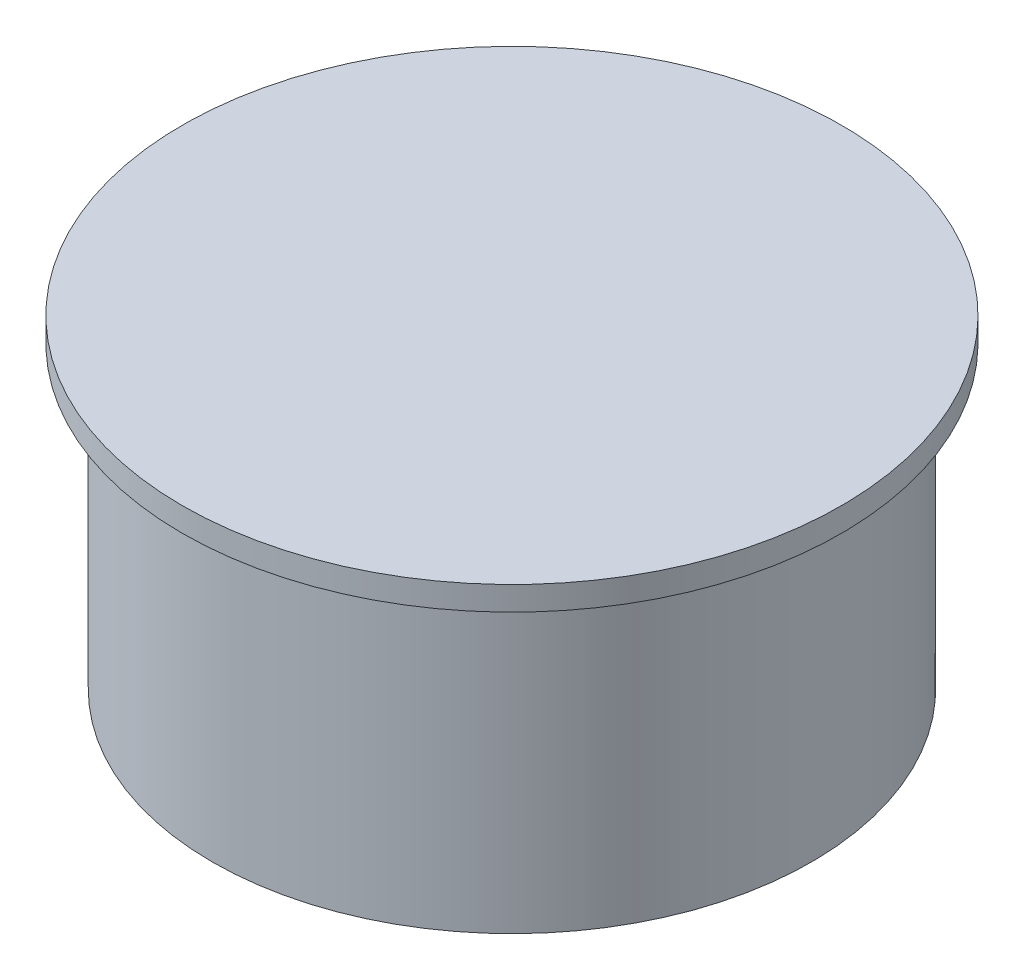
ISO-10303-21;
HEADER;
FILE_DESCRIPTION(('STEP AP214'),'2;1');
FILE_NAME('part.step','',(''),(''),'','','');
FILE_SCHEMA(('AUTOMOTIVE_DESIGN { 1 0 10303 214 1 1 1 1 }'));
ENDSEC;
DATA;
#1=APPLICATION_CONTEXT('core data for automotive mechanical design processes');
#2=APPLICATION_PROTOCOL_DEFINITION('international standard','automotive_design',2000,#1);
#3=PRODUCT_CONTEXT('',#1,'mechanical');
#4=PRODUCT('Part','Part','',(#3));
#5=PRODUCT_RELATED_PRODUCT_CATEGORY('part','',(#4));
#6=PRODUCT_DEFINITION_FORMATION('','',#4);
#7=PRODUCT_DEFINITION_CONTEXT('part definition',#1,'design');
#8=PRODUCT_DEFINITION('design','',#6,#7);
#9=PRODUCT_DEFINITION_SHAPE('','',#8);
#10=(LENGTH_UNIT() NAMED_UNIT(*) SI_UNIT(.MILLI.,.METRE.));
#11=(NAMED_UNIT(*) PLANE_ANGLE_UNIT() SI_UNIT($,.RADIAN.));
#12=(NAMED_UNIT(*) SI_UNIT($,.STERADIAN.) SOLID_ANGLE_UNIT());
#13=UNCERTAINTY_MEASURE_WITH_UNIT(LENGTH_MEASURE(1.E-05),#10,'distance_accuracy_value','');
#14=(GEOMETRIC_REPRESENTATION_CONTEXT(3) GLOBAL_UNCERTAINTY_ASSIGNED_CONTEXT((#13)) GLOBAL_UNIT_ASSIGNED_CONTEXT((#10,
#11,#12)) REPRESENTATION_CONTEXT('',''));
#15=CARTESIAN_POINT('',(0.,0.,0.));
#16=DIRECTION('',(0.,0.,1.));
#17=DIRECTION('',(1.,0.,0.));
#18=AXIS2_PLACEMENT_3D('',#15,#16,#17);
#19=CARTESIAN_POINT('',(0.,5.,0.));
#20=DIRECTION('',(0.,-1.,0.));
#21=DIRECTION('',(0.,0.,-1.));
#22=AXIS2_PLACEMENT_3D('',#19,#20,#21);
#23=CYLINDRICAL_SURFACE('',#22,5.);
#24=CARTESIAN_POINT('',(0.,5.,0.));
#25=DIRECTION('',(0.,1.,0.));
#26=DIRECTION('',(0.,0.,1.));
#27=AXIS2_PLACEMENT_3D('',#24,#25,#26);
#28=CIRCLE('',#27,5.);
#29=CARTESIAN_POINT('',(0.,5.,5.));
#30=VERTEX_POINT('',#29);
#31=EDGE_CURVE('E10',#30,#30,#28,.T.);
#32=ORIENTED_EDGE('',*,*,#31,.F.);
#33=EDGE_LOOP('',(#32));
#34=FACE_BOUND('',#33,.T.);
#35=CARTESIAN_POINT('',(0.,0.,0.));
#36=DIRECTION('',(0.,1.,0.));
#37=DIRECTION('',(0.,0.,1.));
#38=AXIS2_PLACEMENT_3D('',#35,#36,#37);
#39=CIRCLE('',#38,5.);
#40=CARTESIAN_POINT('',(0.,0.,5.));
#41=VERTEX_POINT('',#40);
#42=EDGE_CURVE('E34',#41,#41,#39,.T.);
#43=ORIENTED_EDGE('',*,*,#42,.T.);
#44=EDGE_LOOP('',(#43));
#45=FACE_BOUND('',#44,.T.);
#46=ADVANCED_FACE('F31',(#34,#45),#23,.T.);
#47=CARTESIAN_POINT('',(0.,0.,0.));
#48=DIRECTION('',(0.,1.,0.));
#49=DIRECTION('',(0.,0.,1.));
#50=AXIS2_PLACEMENT_3D('',#47,#48,#49);
#51=PLANE('',#50);
#52=ORIENTED_EDGE('',*,*,#42,.F.);
#53=EDGE_LOOP('',(#52));
#54=FACE_BOUND('',#53,.T.);
#55=ADVANCED_FACE('F59',(#54),#51,.F.);
#56=CARTESIAN_POINT('',(0.,5.,0.));
#57=DIRECTION('',(0.,1.,0.));
#58=DIRECTION('',(0.,0.,1.));
#59=AXIS2_PLACEMENT_3D('',#56,#57,#58);
#60=PLANE('',#59);
#61=CARTESIAN_POINT('',(0.,5.,0.));
#62=DIRECTION('',(0.,1.,0.));
#63=DIRECTION('',(0.,0.,1.));
#64=AXIS2_PLACEMENT_3D('',#61,#62,#63);
#65=CIRCLE('',#64,5.5);
#66=CARTESIAN_POINT('',(0.,5.,5.5));
#67=VERTEX_POINT('',#66);
#68=EDGE_CURVE('E43',#67,#67,#65,.T.);
#69=ORIENTED_EDGE('',*,*,#68,.F.);
#70=EDGE_LOOP('',(#69));
#71=FACE_BOUND('',#70,.T.);
#72=ORIENTED_EDGE('',*,*,#31,.T.);
#73=EDGE_LOOP('',(#72));
#74=FACE_BOUND('',#73,.T.);
#75=ADVANCED_FACE('F54',(#71,#74),#60,.F.);
#76=CARTESIAN_POINT('',(0.,5.4,0.));
#77=DIRECTION('',(0.,-1.,0.));
#78=DIRECTION('',(0.,0.,-1.));
#79=AXIS2_PLACEMENT_3D('',#76,#77,#78);
#80=CYLINDRICAL_SURFACE('',#79,5.5);
#81=CARTESIAN_POINT('',(0.,5.4,0.));
#82=DIRECTION('',(0.,1.,0.));
#83=DIRECTION('',(0.,0.,1.));
#84=AXIS2_PLACEMENT_3D('',#81,#82,#83);
#85=CIRCLE('',#84,5.5);
#86=CARTESIAN_POINT('',(0.,5.4,5.5));
#87=VERTEX_POINT('',#86);
#88=EDGE_CURVE('E41',#87,#87,#85,.T.);
#89=ORIENTED_EDGE('',*,*,#88,.F.);
#90=EDGE_LOOP('',(#89));
#91=FACE_BOUND('',#90,.T.);
#92=ORIENTED_EDGE('',*,*,#68,.T.);
#93=EDGE_LOOP('',(#92));
#94=FACE_BOUND('',#93,.T.);
#95=ADVANCED_FACE('F51',(#91,#94),#80,.T.);
#96=CARTESIAN_POINT('',(0.,5.4,0.));
#97=DIRECTION('',(0.,1.,0.));
#98=DIRECTION('',(0.,0.,1.));
#99=AXIS2_PLACEMENT_3D('',#96,#97,#98);
#100=PLANE('',#99);
#101=ORIENTED_EDGE('',*,*,#88,.T.);
#102=EDGE_LOOP('',(#101));
#103=FACE_BOUND('',#102,.T.);
#104=ADVANCED_FACE('F49',(#103),#100,.T.);
#105=CLOSED_SHELL('',(#46,#55,#75,#95,#104));
#106=MANIFOLD_SOLID_BREP('B2',#105);
#107=ADVANCED_BREP_SHAPE_REPRESENTATION('',(#18,#106),#14);
#108=SHAPE_DEFINITION_REPRESENTATION(#9,#107);
ENDSEC;
END-ISO-10303-21;
